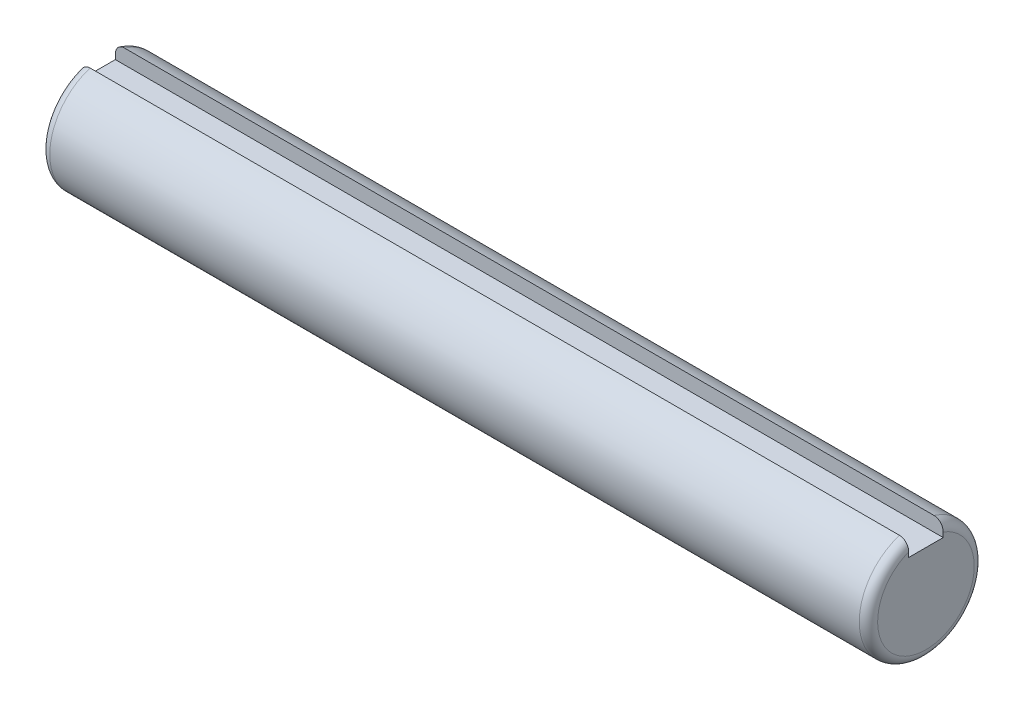
ISO-10303-21;
HEADER;
FILE_DESCRIPTION(('STEP AP214'),'2;1');
FILE_NAME('part.step','',(''),(''),'','','');
FILE_SCHEMA(('AUTOMOTIVE_DESIGN { 1 0 10303 214 1 1 1 1 }'));
ENDSEC;
DATA;
#1=APPLICATION_CONTEXT('core data for automotive mechanical design processes');
#2=APPLICATION_PROTOCOL_DEFINITION('international standard','automotive_design',2000,#1);
#3=PRODUCT_CONTEXT('',#1,'mechanical');
#4=PRODUCT('Part','Part','',(#3));
#5=PRODUCT_RELATED_PRODUCT_CATEGORY('part','',(#4));
#6=PRODUCT_DEFINITION_FORMATION('','',#4);
#7=PRODUCT_DEFINITION_CONTEXT('part definition',#1,'design');
#8=PRODUCT_DEFINITION('design','',#6,#7);
#9=PRODUCT_DEFINITION_SHAPE('','',#8);
#10=(LENGTH_UNIT() NAMED_UNIT(*) SI_UNIT(.MILLI.,.METRE.));
#11=(NAMED_UNIT(*) PLANE_ANGLE_UNIT() SI_UNIT($,.RADIAN.));
#12=(NAMED_UNIT(*) SI_UNIT($,.STERADIAN.) SOLID_ANGLE_UNIT());
#13=UNCERTAINTY_MEASURE_WITH_UNIT(LENGTH_MEASURE(1.E-05),#10,'distance_accuracy_value','');
#14=(GEOMETRIC_REPRESENTATION_CONTEXT(3) GLOBAL_UNCERTAINTY_ASSIGNED_CONTEXT((#13)) GLOBAL_UNIT_ASSIGNED_CONTEXT((#10,
#11,#12)) REPRESENTATION_CONTEXT('',''));
#15=CARTESIAN_POINT('',(0.,0.,0.));
#16=DIRECTION('',(0.,0.,1.));
#17=DIRECTION('',(1.,0.,0.));
#18=AXIS2_PLACEMENT_3D('',#15,#16,#17);
#19=CARTESIAN_POINT('',(114.3,0.,0.));
#20=DIRECTION('',(-1.,0.,0.));
#21=DIRECTION('',(0.,0.,1.));
#22=AXIS2_PLACEMENT_3D('',#19,#20,#21);
#23=CYLINDRICAL_SURFACE('',#22,7.9375);
#24=DIRECTION('',(-1.,0.,0.));
#25=VECTOR('',#24,1.);
#26=CARTESIAN_POINT('',(114.3,7.57189241124701,-2.38125));
#27=LINE('',#26,#25);
#28=CARTESIAN_POINT('',(1.26999999999999,7.57189241124701,-2.38125));
#29=VERTEX_POINT('',#28);
#30=CARTESIAN_POINT('',(113.03,7.57189241124701,-2.38125));
#31=VERTEX_POINT('',#30);
#32=EDGE_CURVE('E112',#29,#31,#27,.F.);
#33=ORIENTED_EDGE('',*,*,#32,.T.);
#34=CARTESIAN_POINT('',(113.03,0.,0.));
#35=DIRECTION('',(1.,0.,0.));
#36=DIRECTION('',(0.,0.,-1.));
#37=AXIS2_PLACEMENT_3D('',#34,#35,#36);
#38=CIRCLE('',#37,7.9375);
#39=CARTESIAN_POINT('',(113.03,7.57189241124701,2.38125));
#40=VERTEX_POINT('',#39);
#41=EDGE_CURVE('E157',#31,#40,#38,.F.);
#42=ORIENTED_EDGE('',*,*,#41,.T.);
#43=DIRECTION('',(-1.,0.,0.));
#44=VECTOR('',#43,1.);
#45=CARTESIAN_POINT('',(114.3,7.57189241124701,2.38125));
#46=LINE('',#45,#44);
#47=CARTESIAN_POINT('',(1.26999999999999,7.57189241124701,2.38125));
#48=VERTEX_POINT('',#47);
#49=EDGE_CURVE('E93',#40,#48,#46,.T.);
#50=ORIENTED_EDGE('',*,*,#49,.T.);
#51=CARTESIAN_POINT('',(1.26999999999999,0.,0.));
#52=DIRECTION('',(1.,0.,0.));
#53=DIRECTION('',(0.,0.,-1.));
#54=AXIS2_PLACEMENT_3D('',#51,#52,#53);
#55=CIRCLE('',#54,7.9375);
#56=EDGE_CURVE('E159',#48,#29,#55,.T.);
#57=ORIENTED_EDGE('',*,*,#56,.T.);
#58=EDGE_LOOP('',(#33,#42,#50,#57));
#59=FACE_BOUND('',#58,.T.);
#60=ADVANCED_FACE('F33',(#59),#23,.T.);
#61=CARTESIAN_POINT('',(114.3,0.,0.));
#62=DIRECTION('',(1.,0.,0.));
#63=DIRECTION('',(0.,0.,-1.));
#64=AXIS2_PLACEMENT_3D('',#61,#62,#63);
#65=PLANE('',#64);
#66=DIRECTION('',(0.,1.,0.));
#67=VECTOR('',#66,1.);
#68=CARTESIAN_POINT('',(114.3,7.9375,2.38125));
#69=LINE('',#68,#67);
#70=CARTESIAN_POINT('',(114.3,5.55625,2.38125));
#71=VERTEX_POINT('',#70);
#72=CARTESIAN_POINT('',(114.3,6.22777686558374,2.38125));
#73=VERTEX_POINT('',#72);
#74=EDGE_CURVE('E89',#71,#73,#69,.T.);
#75=ORIENTED_EDGE('',*,*,#74,.T.);
#76=CARTESIAN_POINT('',(114.3,0.,0.));
#77=DIRECTION('',(1.,0.,0.));
#78=DIRECTION('',(0.,0.,-1.));
#79=AXIS2_PLACEMENT_3D('',#76,#77,#78);
#80=CIRCLE('',#79,6.6675);
#81=CARTESIAN_POINT('',(114.3,6.22777686558374,-2.38125));
#82=VERTEX_POINT('',#81);
#83=EDGE_CURVE('E117',#73,#82,#80,.T.);
#84=ORIENTED_EDGE('',*,*,#83,.T.);
#85=DIRECTION('',(0.,-1.,0.));
#86=VECTOR('',#85,1.);
#87=CARTESIAN_POINT('',(114.3,7.9375,-2.38125));
#88=LINE('',#87,#86);
#89=CARTESIAN_POINT('',(114.3,5.55625,-2.38125));
#90=VERTEX_POINT('',#89);
#91=EDGE_CURVE('E103',#82,#90,#88,.T.);
#92=ORIENTED_EDGE('',*,*,#91,.T.);
#93=DIRECTION('',(0.,0.,1.));
#94=VECTOR('',#93,1.);
#95=CARTESIAN_POINT('',(114.3,5.55625,-2.38125));
#96=LINE('',#95,#94);
#97=EDGE_CURVE('E105',#90,#71,#96,.T.);
#98=ORIENTED_EDGE('',*,*,#97,.T.);
#99=EDGE_LOOP('',(#75,#84,#92,#98));
#100=FACE_BOUND('',#99,.T.);
#101=ADVANCED_FACE('F144',(#100),#65,.T.);
#102=CARTESIAN_POINT('',(0.,0.,0.));
#103=DIRECTION('',(1.,0.,0.));
#104=DIRECTION('',(0.,0.,-1.));
#105=AXIS2_PLACEMENT_3D('',#102,#103,#104);
#106=PLANE('',#105);
#107=DIRECTION('',(0.,1.,0.));
#108=VECTOR('',#107,1.);
#109=CARTESIAN_POINT('',(0.,0.,-2.38125));
#110=LINE('',#109,#108);
#111=CARTESIAN_POINT('',(0.,5.55625,-2.38125));
#112=VERTEX_POINT('',#111);
#113=CARTESIAN_POINT('',(0.,6.22777686558374,-2.38125));
#114=VERTEX_POINT('',#113);
#115=EDGE_CURVE('E115',#112,#114,#110,.T.);
#116=ORIENTED_EDGE('',*,*,#115,.T.);
#117=CARTESIAN_POINT('',(0.,0.,0.));
#118=DIRECTION('',(1.,0.,0.));
#119=DIRECTION('',(0.,0.,-1.));
#120=AXIS2_PLACEMENT_3D('',#117,#118,#119);
#121=CIRCLE('',#120,6.6675);
#122=CARTESIAN_POINT('',(0.,6.22777686558374,2.38125));
#123=VERTEX_POINT('',#122);
#124=EDGE_CURVE('E11',#114,#123,#121,.F.);
#125=ORIENTED_EDGE('',*,*,#124,.T.);
#126=DIRECTION('',(0.,1.,0.));
#127=VECTOR('',#126,1.);
#128=CARTESIAN_POINT('',(0.,7.9375,2.38125));
#129=LINE('',#128,#127);
#130=CARTESIAN_POINT('',(0.,5.55625,2.38125));
#131=VERTEX_POINT('',#130);
#132=EDGE_CURVE('E87',#131,#123,#129,.T.);
#133=ORIENTED_EDGE('',*,*,#132,.F.);
#134=DIRECTION('',(0.,0.,1.));
#135=VECTOR('',#134,1.);
#136=CARTESIAN_POINT('',(0.,5.55625,-2.38125));
#137=LINE('',#136,#135);
#138=EDGE_CURVE('E97',#112,#131,#137,.T.);
#139=ORIENTED_EDGE('',*,*,#138,.F.);
#140=EDGE_LOOP('',(#116,#125,#133,#139));
#141=FACE_BOUND('',#140,.T.);
#142=ADVANCED_FACE('F102',(#141),#106,.F.);
#143=CARTESIAN_POINT('',(114.3,7.9375,-2.38125));
#144=DIRECTION('',(0.,0.,-1.));
#145=DIRECTION('',(0.,1.,0.));
#146=AXIS2_PLACEMENT_3D('',#143,#144,#145);
#147=PLANE('',#146);
#148=ORIENTED_EDGE('',*,*,#91,.F.);
#149=CARTESIAN_POINT('',(114.3,6.22777686558374,-2.38125));
#150=CARTESIAN_POINT('',(114.299998528073,6.26746920768222,-2.38125));
#151=CARTESIAN_POINT('',(114.298375506917,6.30714471719812,-2.38125));
#152=CARTESIAN_POINT('',(114.291868593464,6.38623440027711,-2.38125));
#153=CARTESIAN_POINT('',(114.286984091404,6.42564852357975,-2.38125));
#154=CARTESIAN_POINT('',(114.267403478485,6.54318961193378,-2.38125));
#155=CARTESIAN_POINT('',(114.247780210864,6.62055912419595,-2.38125));
#156=CARTESIAN_POINT('',(114.195593666547,6.77092803907803,-2.38125));
#157=CARTESIAN_POINT('',(114.163008988659,6.84391998315476,-2.38125));
#158=CARTESIAN_POINT('',(114.085537025993,6.9830062031715,-2.38125));
#159=CARTESIAN_POINT('',(114.040661985263,7.04910725402659,-2.38125));
#160=CARTESIAN_POINT('',(113.941831114961,7.16950367034176,-2.38125));
#161=CARTESIAN_POINT('',(113.888340051646,7.22418031329653,-2.38125));
#162=CARTESIAN_POINT('',(113.772446305722,7.32316184557244,-2.38125));
#163=CARTESIAN_POINT('',(113.71004274358,7.36746571011188,-2.38125));
#164=CARTESIAN_POINT('',(113.581807907929,7.44188836367711,-2.38125));
#165=CARTESIAN_POINT('',(113.516347040745,7.47264703480536,-2.38125));
#166=CARTESIAN_POINT('',(113.381084211625,7.52219404643524,-2.38125));
#167=CARTESIAN_POINT('',(113.311288225768,7.54099848108937,-2.38125));
#168=CARTESIAN_POINT('',(113.205698219697,7.55960994279615,-2.38125));
#169=CARTESIAN_POINT('',(113.17068986685,7.56421473857423,-2.38125));
#170=CARTESIAN_POINT('',(113.100460345722,7.57035365413695,-2.38125));
#171=CARTESIAN_POINT('',(113.065239597496,7.57189258013769,-2.38125));
#172=CARTESIAN_POINT('',(113.03,7.57189241124701,-2.38125));
#173=B_SPLINE_CURVE_WITH_KNOTS('',3,(#149,#150,#151,#152,#153,#154,#155,#156,#157,#158,#159,
#160,#161,#162,#163,#164,#165,#166,#167,#168,#169,#170,#171,#172),.UNSPECIFIED.,.F.,.F.,(4,2,2,
2,2,2,2,2,2,2,2,4),(0.,0.119008994262538,0.238040244591039,0.476269189014304,0.714893128118571,
0.953280201845112,1.1815769417372,1.40989622676439,1.62581139201883,1.84143524864311,
1.94724924271294,2.05289722634979),.UNSPECIFIED.);
#174=EDGE_CURVE('E127',#82,#31,#173,.T.);
#175=ORIENTED_EDGE('',*,*,#174,.T.);
#176=ORIENTED_EDGE('',*,*,#32,.F.);
#177=CARTESIAN_POINT('',(1.26999999999999,7.57189241124701,-2.38125));
#178=CARTESIAN_POINT('',(1.23551836399688,7.57189289429141,-2.38125));
#179=CARTESIAN_POINT('',(1.20105361942005,7.57041930573939,-2.38125));
#180=CARTESIAN_POINT('',(1.1323788142634,7.56454546509445,-2.38125));
#181=CARTESIAN_POINT('',(1.09816872185665,7.56014558516341,-2.38125));
#182=CARTESIAN_POINT('',(0.996427493826767,7.54262070700895,-2.38125));
#183=CARTESIAN_POINT('',(0.929591232531725,7.52517019137308,-2.38125));
#184=CARTESIAN_POINT('',(0.799822110541258,7.47933064751606,-2.38125));
#185=CARTESIAN_POINT('',(0.736889619357123,7.45094058564105,-2.38125));
#186=CARTESIAN_POINT('',(0.616561156146563,7.38416980483457,-2.38125));
#187=CARTESIAN_POINT('',(0.559165988873736,7.34578763671329,-2.38125));
#188=CARTESIAN_POINT('',(0.450410383645044,7.259511411966,-2.38125));
#189=CARTESIAN_POINT('',(0.39917202535662,7.21146377619617,-2.38125));
#190=CARTESIAN_POINT('',(0.305078578158769,7.1077695190399,-2.38125));
#191=CARTESIAN_POINT('',(0.262224959793136,7.05212156758543,-2.38125));
#192=CARTESIAN_POINT('',(0.184082887223281,6.93223977060406,-2.38125));
#193=CARTESIAN_POINT('',(0.149208405715618,6.86773648701536,-2.38125));
#194=CARTESIAN_POINT('',(0.0901478489827821,6.73399363940395,-2.38125));
#195=CARTESIAN_POINT('',(0.0659654049501871,6.66475247552374,-2.38125));
#196=CARTESIAN_POINT('',(0.0315175577076031,6.53433601463791,-2.38125));
#197=CARTESIAN_POINT('',(0.0196785603699602,6.47356869549316,-2.38125));
#198=CARTESIAN_POINT('',(0.00391965095726519,6.35112482772287,-2.38125));
#199=CARTESIAN_POINT('',(-1.44889728941281E-05,6.28945011429513,-2.38125));
#200=CARTESIAN_POINT('',(0.,6.22777686558374,-2.38125));
#201=B_SPLINE_CURVE_WITH_KNOTS('',3,(#177,#178,#179,#180,#181,#182,#183,#184,#185,#186,#187,
#188,#189,#190,#191,#192,#193,#194,#195,#196,#197,#198,#199,#200),.UNSPECIFIED.,.F.,.F.,(4,2,2,
2,2,2,2,2,2,2,2,4),(0.,0.103380079436691,0.206747013644793,0.412905920175525,0.619084310990282,
0.825292621247293,1.03508121144468,1.24490656215254,1.46392979591955,1.68302735656662,
1.8682521594197,2.05314327872479),.UNSPECIFIED.);
#202=EDGE_CURVE('E120',#29,#114,#201,.T.);
#203=ORIENTED_EDGE('',*,*,#202,.T.);
#204=ORIENTED_EDGE('',*,*,#115,.F.);
#205=DIRECTION('',(-1.,0.,0.));
#206=VECTOR('',#205,1.);
#207=CARTESIAN_POINT('',(114.3,5.55625,-2.38125));
#208=LINE('',#207,#206);
#209=EDGE_CURVE('E94',#90,#112,#208,.T.);
#210=ORIENTED_EDGE('',*,*,#209,.F.);
#211=EDGE_LOOP('',(#148,#175,#176,#203,#204,#210));
#212=FACE_BOUND('',#211,.T.);
#213=ADVANCED_FACE('F135',(#212),#147,.F.);
#214=CARTESIAN_POINT('',(114.3,7.9375,2.38125));
#215=DIRECTION('',(0.,0.,1.));
#216=DIRECTION('',(0.,-1.,0.));
#217=AXIS2_PLACEMENT_3D('',#214,#215,#216);
#218=PLANE('',#217);
#219=ORIENTED_EDGE('',*,*,#49,.F.);
#220=CARTESIAN_POINT('',(113.03,7.57189241124701,2.38125));
#221=CARTESIAN_POINT('',(113.064481636003,7.57189289429142,2.38125));
#222=CARTESIAN_POINT('',(113.09894638058,7.57041930573939,2.38125));
#223=CARTESIAN_POINT('',(113.167621185737,7.56454546509445,2.38125));
#224=CARTESIAN_POINT('',(113.201831278143,7.56014558516341,2.38125));
#225=CARTESIAN_POINT('',(113.303572506173,7.54262070700895,2.38125));
#226=CARTESIAN_POINT('',(113.370408767468,7.52517019137308,2.38125));
#227=CARTESIAN_POINT('',(113.500177889459,7.47933064751606,2.38125));
#228=CARTESIAN_POINT('',(113.563110380643,7.45094058564105,2.38125));
#229=CARTESIAN_POINT('',(113.683438843853,7.38416980483457,2.38125));
#230=CARTESIAN_POINT('',(113.740834011126,7.34578763671329,2.38125));
#231=CARTESIAN_POINT('',(113.849589616355,7.259511411966,2.38125));
#232=CARTESIAN_POINT('',(113.900827974643,7.21146377619617,2.38125));
#233=CARTESIAN_POINT('',(113.994921421841,7.1077695190399,2.38125));
#234=CARTESIAN_POINT('',(114.037775040207,7.05212156758543,2.38125));
#235=CARTESIAN_POINT('',(114.115917112777,6.93223977060406,2.38125));
#236=CARTESIAN_POINT('',(114.150791594284,6.86773648701536,2.38125));
#237=CARTESIAN_POINT('',(114.209852151017,6.73399363940395,2.38125));
#238=CARTESIAN_POINT('',(114.23403459505,6.66475247552374,2.38125));
#239=CARTESIAN_POINT('',(114.268482442292,6.53433601463792,2.38125));
#240=CARTESIAN_POINT('',(114.28032143963,6.47356869549316,2.38125));
#241=CARTESIAN_POINT('',(114.296080349043,6.35112482772287,2.38125));
#242=CARTESIAN_POINT('',(114.300014488973,6.28945011429513,2.38125));
#243=CARTESIAN_POINT('',(114.3,6.22777686558374,2.38125));
#244=B_SPLINE_CURVE_WITH_KNOTS('',3,(#220,#221,#222,#223,#224,#225,#226,#227,#228,#229,#230,
#231,#232,#233,#234,#235,#236,#237,#238,#239,#240,#241,#242,#243),.UNSPECIFIED.,.F.,.F.,(4,2,2,
2,2,2,2,2,2,2,2,4),(0.,0.10338007943669,0.206747013644786,0.412905920175521,0.619084310990287,
0.825292621247291,1.03508121144468,1.24490656215254,1.46392979591955,1.68302735656662,
1.8682521594197,2.05314327872479),.UNSPECIFIED.);
#245=EDGE_CURVE('E40',#40,#73,#244,.T.);
#246=ORIENTED_EDGE('',*,*,#245,.T.);
#247=ORIENTED_EDGE('',*,*,#74,.F.);
#248=DIRECTION('',(-1.,0.,0.));
#249=VECTOR('',#248,1.);
#250=CARTESIAN_POINT('',(114.3,5.55625,2.38125));
#251=LINE('',#250,#249);
#252=EDGE_CURVE('E84',#71,#131,#251,.T.);
#253=ORIENTED_EDGE('',*,*,#252,.T.);
#254=ORIENTED_EDGE('',*,*,#132,.T.);
#255=CARTESIAN_POINT('',(0.,6.22777686558374,2.38125));
#256=CARTESIAN_POINT('',(1.47192659061853E-06,6.26746920768222,2.38125));
#257=CARTESIAN_POINT('',(0.00162449308314774,6.30714471719812,2.38125));
#258=CARTESIAN_POINT('',(0.00813140653589272,6.38623440027711,2.38125));
#259=CARTESIAN_POINT('',(0.0130159085961441,6.42564852357975,2.38125));
#260=CARTESIAN_POINT('',(0.0325965215149344,6.54318961193378,2.38125));
#261=CARTESIAN_POINT('',(0.0522197891358188,6.62055912419595,2.38125));
#262=CARTESIAN_POINT('',(0.104406333453264,6.77092803907803,2.38125));
#263=CARTESIAN_POINT('',(0.136991011340631,6.84391998315475,2.38125));
#264=CARTESIAN_POINT('',(0.214462974006576,6.9830062031715,2.38125));
#265=CARTESIAN_POINT('',(0.259338014737296,7.04910725402658,2.38125));
#266=CARTESIAN_POINT('',(0.358168885038831,7.16950367034176,2.38125));
#267=CARTESIAN_POINT('',(0.411659948354076,7.22418031329653,2.38125));
#268=CARTESIAN_POINT('',(0.527553694278201,7.32316184557244,2.38125));
#269=CARTESIAN_POINT('',(0.589957256420304,7.36746571011187,2.38125));
#270=CARTESIAN_POINT('',(0.718192092071095,7.44188836367711,2.38125));
#271=CARTESIAN_POINT('',(0.783652959254536,7.47264703480536,2.38125));
#272=CARTESIAN_POINT('',(0.91891578837505,7.52219404643524,2.38125));
#273=CARTESIAN_POINT('',(0.988711774232018,7.54099848108937,2.38125));
#274=CARTESIAN_POINT('',(1.09430178030347,7.55960994279615,2.38125));
#275=CARTESIAN_POINT('',(1.12931013315022,7.56421473857423,2.38125));
#276=CARTESIAN_POINT('',(1.19953965427754,7.57035365413695,2.38125));
#277=CARTESIAN_POINT('',(1.23476040250425,7.57189258013769,2.38125));
#278=CARTESIAN_POINT('',(1.26999999999999,7.571892411247,2.38125));
#279=B_SPLINE_CURVE_WITH_KNOTS('',3,(#255,#256,#257,#258,#259,#260,#261,#262,#263,#264,#265,
#266,#267,#268,#269,#270,#271,#272,#273,#274,#275,#276,#277,#278),.UNSPECIFIED.,.F.,.F.,(4,2,2,
2,2,2,2,2,2,2,2,4),(0.,0.119008994262537,0.238040244591036,0.476269189014302,0.714893128118568,
0.953280201845105,1.18157694173719,1.40989622676439,1.62581139201882,1.84143524864311,
1.94724924271292,2.0528972263498),.UNSPECIFIED.);
#280=EDGE_CURVE('E52',#123,#48,#279,.T.);
#281=ORIENTED_EDGE('',*,*,#280,.T.);
#282=EDGE_LOOP('',(#219,#246,#247,#253,#254,#281));
#283=FACE_BOUND('',#282,.T.);
#284=ADVANCED_FACE('F86',(#283),#218,.F.);
#285=CARTESIAN_POINT('',(114.3,5.55625,-2.38125));
#286=DIRECTION('',(0.,-1.,0.));
#287=DIRECTION('',(0.,0.,-1.));
#288=AXIS2_PLACEMENT_3D('',#285,#286,#287);
#289=PLANE('',#288);
#290=ORIENTED_EDGE('',*,*,#138,.T.);
#291=ORIENTED_EDGE('',*,*,#252,.F.);
#292=ORIENTED_EDGE('',*,*,#97,.F.);
#293=ORIENTED_EDGE('',*,*,#209,.T.);
#294=EDGE_LOOP('',(#290,#291,#292,#293));
#295=FACE_BOUND('',#294,.T.);
#296=ADVANCED_FACE('F98',(#295),#289,.F.);
#297=CARTESIAN_POINT('',(113.03,0.,0.));
#298=DIRECTION('',(1.,0.,0.));
#299=DIRECTION('',(0.,0.,-1.));
#300=AXIS2_PLACEMENT_3D('',#297,#298,#299);
#301=TOROIDAL_SURFACE('',#300,6.6675,1.27);
#302=ORIENTED_EDGE('',*,*,#245,.F.);
#303=ORIENTED_EDGE('',*,*,#41,.F.);
#304=ORIENTED_EDGE('',*,*,#174,.F.);
#305=ORIENTED_EDGE('',*,*,#83,.F.);
#306=EDGE_LOOP('',(#302,#303,#304,#305));
#307=FACE_BOUND('',#306,.T.);
#308=ADVANCED_FACE('F155',(#307),#301,.T.);
#309=CARTESIAN_POINT('',(1.26999999999999,0.,0.));
#310=DIRECTION('',(1.,0.,0.));
#311=DIRECTION('',(0.,0.,-1.));
#312=AXIS2_PLACEMENT_3D('',#309,#310,#311);
#313=TOROIDAL_SURFACE('',#312,6.6675,1.27);
#314=ORIENTED_EDGE('',*,*,#280,.F.);
#315=ORIENTED_EDGE('',*,*,#124,.F.);
#316=ORIENTED_EDGE('',*,*,#202,.F.);
#317=ORIENTED_EDGE('',*,*,#56,.F.);
#318=EDGE_LOOP('',(#314,#315,#316,#317));
#319=FACE_BOUND('',#318,.T.);
#320=ADVANCED_FACE('F133',(#319),#313,.T.);
#321=CLOSED_SHELL('',(#60,#101,#142,#213,#284,#296,#308,#320));
#322=MANIFOLD_SOLID_BREP('B2',#321);
#323=ADVANCED_BREP_SHAPE_REPRESENTATION('',(#18,#322),#14);
#324=SHAPE_DEFINITION_REPRESENTATION(#9,#323);
ENDSEC;
END-ISO-10303-21;
